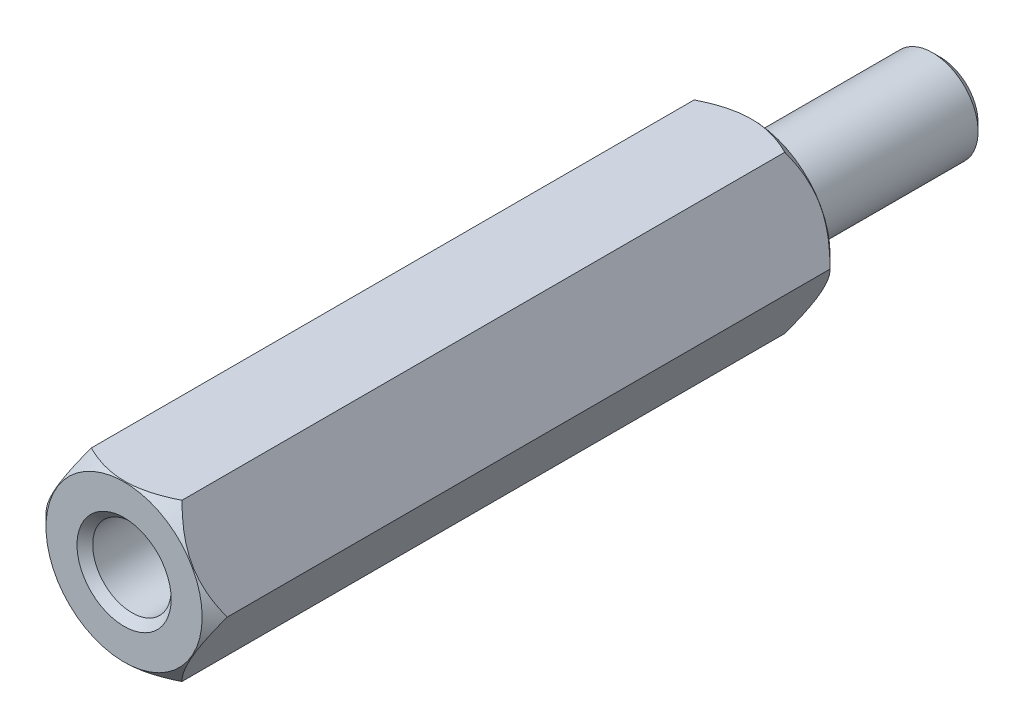
ISO-10303-21;
HEADER;
FILE_DESCRIPTION(('STEP AP214'),'2;1');
FILE_NAME('part.step','',(''),(''),'','','');
FILE_SCHEMA(('AUTOMOTIVE_DESIGN { 1 0 10303 214 1 1 1 1 }'));
ENDSEC;
DATA;
#1=APPLICATION_CONTEXT('core data for automotive mechanical design processes');
#2=APPLICATION_PROTOCOL_DEFINITION('international standard','automotive_design',2000,#1);
#3=PRODUCT_CONTEXT('',#1,'mechanical');
#4=PRODUCT('Part','Part','',(#3));
#5=PRODUCT_RELATED_PRODUCT_CATEGORY('part','',(#4));
#6=PRODUCT_DEFINITION_FORMATION('','',#4);
#7=PRODUCT_DEFINITION_CONTEXT('part definition',#1,'design');
#8=PRODUCT_DEFINITION('design','',#6,#7);
#9=PRODUCT_DEFINITION_SHAPE('','',#8);
#10=(LENGTH_UNIT() NAMED_UNIT(*) SI_UNIT(.MILLI.,.METRE.));
#11=(NAMED_UNIT(*) PLANE_ANGLE_UNIT() SI_UNIT($,.RADIAN.));
#12=(NAMED_UNIT(*) SI_UNIT($,.STERADIAN.) SOLID_ANGLE_UNIT());
#13=UNCERTAINTY_MEASURE_WITH_UNIT(LENGTH_MEASURE(1.E-05),#10,'distance_accuracy_value','');
#14=(GEOMETRIC_REPRESENTATION_CONTEXT(3) GLOBAL_UNCERTAINTY_ASSIGNED_CONTEXT((#13)) GLOBAL_UNIT_ASSIGNED_CONTEXT((#10,
#11,#12)) REPRESENTATION_CONTEXT('',''));
#15=CARTESIAN_POINT('',(0.,0.,0.));
#16=DIRECTION('',(0.,0.,1.));
#17=DIRECTION('',(1.,0.,0.));
#18=AXIS2_PLACEMENT_3D('',#15,#16,#17);
#19=CARTESIAN_POINT('',(0.,0.,10.));
#20=DIRECTION('',(0.,0.,1.));
#21=DIRECTION('',(1.,0.,0.));
#22=AXIS2_PLACEMENT_3D('',#19,#20,#21);
#23=CYLINDRICAL_SURFACE('',#22,1.24999999999999);
#24=CARTESIAN_POINT('',(0.,0.,9.75000000000001));
#25=DIRECTION('',(0.,0.,1.));
#26=DIRECTION('',(1.,0.,0.));
#27=AXIS2_PLACEMENT_3D('',#24,#25,#26);
#28=CIRCLE('',#27,1.24999999999999);
#29=CARTESIAN_POINT('',(1.24999999999999,0.,9.75000000000001));
#30=VERTEX_POINT('',#29);
#31=EDGE_CURVE('E50',#30,#30,#28,.T.);
#32=ORIENTED_EDGE('',*,*,#31,.T.);
#33=EDGE_LOOP('',(#32));
#34=FACE_BOUND('',#33,.T.);
#35=CARTESIAN_POINT('',(0.,0.,-8.));
#36=DIRECTION('',(0.,0.,-1.));
#37=DIRECTION('',(-1.,0.,0.));
#38=AXIS2_PLACEMENT_3D('',#35,#36,#37);
#39=CIRCLE('',#38,1.24999999999999);
#40=CARTESIAN_POINT('',(-1.24999999999999,0.,-8.));
#41=VERTEX_POINT('',#40);
#42=EDGE_CURVE('E117',#41,#41,#39,.F.);
#43=ORIENTED_EDGE('',*,*,#42,.F.);
#44=EDGE_LOOP('',(#43));
#45=FACE_BOUND('',#44,.T.);
#46=ADVANCED_FACE('F40',(#34,#45),#23,.F.);
#47=CARTESIAN_POINT('',(1.44337567297409,-2.49999999999998,10.));
#48=DIRECTION('',(-0.866025403784442,0.499999999999995,0.));
#49=DIRECTION('',(-0.499999999999995,-0.866025403784442,0.));
#50=AXIS2_PLACEMENT_3D('',#47,#48,#49);
#51=PLANE('',#50);
#52=CARTESIAN_POINT('',(1.44326020292026,-2.50019999999999,9.59988452301824));
#53=CARTESIAN_POINT('',(1.49287669073471,-2.41426172221222,9.64945929464527));
#54=CARTESIAN_POINT('',(1.54332283764112,-2.32688643272423,9.69612251863749));
#55=CARTESIAN_POINT('',(1.64618811625262,-2.1487185438344,9.7815618599617));
#56=CARTESIAN_POINT('',(1.69861703122362,-2.05790899931891,9.82029043759399));
#57=CARTESIAN_POINT('',(1.80433744175988,-1.87479587687307,9.88663329610226));
#58=CARTESIAN_POINT('',(1.85760201171318,-1.78253893547065,9.91441433146914));
#59=CARTESIAN_POINT('',(1.96530378549011,-1.5959939912237,9.95721682408933));
#60=CARTESIAN_POINT('',(2.01973769896308,-1.50171168743371,9.97227023332865));
#61=CARTESIAN_POINT('',(2.11355131286834,-1.33922174170815,9.98585227779051));
#62=CARTESIAN_POINT('',(2.15280980880343,-1.27122403211984,9.98786290075919));
#63=CARTESIAN_POINT('',(2.23126263056551,-1.13533975883077,9.98447588281251));
#64=CARTESIAN_POINT('',(2.27045692907359,-1.06745324244775,9.97907564470017));
#65=CARTESIAN_POINT('',(2.34847544336506,-0.932321211763883,9.96117421159752));
#66=CARTESIAN_POINT('',(2.38729919566124,-0.865076500246428,9.94866507295351));
#67=CARTESIAN_POINT('',(2.46427534467605,-0.731749899181788,9.91723249804429));
#68=CARTESIAN_POINT('',(2.50242779262543,-0.66566792090033,9.89830955350318));
#69=CARTESIAN_POINT('',(2.60015256308363,-0.496403653308724,9.84213263859175));
#70=CARTESIAN_POINT('',(2.6591189485299,-0.394270877777098,9.80064416840381));
#71=CARTESIAN_POINT('',(2.74582384890658,-0.244093585059486,9.73060595327691));
#72=CARTESIAN_POINT('',(2.77439698586413,-0.194603460117387,9.70599774788392));
#73=CARTESIAN_POINT('',(2.83101398781794,-0.0965399361611519,9.65453811328476));
#74=CARTESIAN_POINT('',(2.85905816495513,-0.0479659965030718,9.62768806122065));
#75=CARTESIAN_POINT('',(2.88686681600197,0.000199999999999628,9.59988452301824));
#76=B_SPLINE_CURVE_WITH_KNOTS('',3,(#52,#53,#54,#55,#56,#57,#58,#59,#60,#61,#62,#63,#64,#65,#66,
#67,#68,#69,#70,#71,#72,#73,#74,#75),.UNSPECIFIED.,.F.,.F.,(4,2,2,2,2,2,2,2,2,2,2,4),(0.,
0.333012085133922,0.667964518301391,0.99759703204329,1.32639954393843,1.56169424147167,
1.79707142102082,2.0327121352217,2.2683347877565,2.64260240809531,2.82922877818861,
3.01574133749022),.UNSPECIFIED.);
#77=CARTESIAN_POINT('',(1.4433756729741,-2.49999999999999,9.6));
#78=VERTEX_POINT('',#77);
#79=CARTESIAN_POINT('',(2.88675134594813,0.,9.6));
#80=VERTEX_POINT('',#79);
#81=EDGE_CURVE('E94',#78,#80,#76,.T.);
#82=ORIENTED_EDGE('',*,*,#81,.F.);
#83=DIRECTION('',(0.,0.,-1.));
#84=VECTOR('',#83,1.);
#85=CARTESIAN_POINT('',(1.44337567297409,-2.49999999999998,10.));
#86=LINE('',#85,#84);
#87=CARTESIAN_POINT('',(1.44337567297409,-2.49999999999998,-9.60000000000001));
#88=VERTEX_POINT('',#87);
#89=EDGE_CURVE('E65',#78,#88,#86,.T.);
#90=ORIENTED_EDGE('',*,*,#89,.T.);
#91=CARTESIAN_POINT('',(2.88686681600197,0.0002,-9.59988452301824));
#92=CARTESIAN_POINT('',(2.83725032818751,-0.0857382777877641,-9.64945929464528));
#93=CARTESIAN_POINT('',(2.7868041812811,-0.173113567275752,-9.69612251863749));
#94=CARTESIAN_POINT('',(2.68393890266961,-0.351281456165586,-9.7815618599617));
#95=CARTESIAN_POINT('',(2.63150998769861,-0.442091000681072,-9.82029043759399));
#96=CARTESIAN_POINT('',(2.52578957716235,-0.625204123126917,-9.88663329610226));
#97=CARTESIAN_POINT('',(2.47252500720905,-0.717461064529336,-9.91441433146914));
#98=CARTESIAN_POINT('',(2.36482323343211,-0.90400600877628,-9.95721682408933));
#99=CARTESIAN_POINT('',(2.31038931995914,-0.998288312566276,-9.97227023332865));
#100=CARTESIAN_POINT('',(2.21657570605388,-1.16077825829184,-9.98585227779051));
#101=CARTESIAN_POINT('',(2.1773172101188,-1.22877596788014,-9.98786290075919));
#102=CARTESIAN_POINT('',(2.09886438835672,-1.36466024116921,-9.98447588281251));
#103=CARTESIAN_POINT('',(2.05967008984864,-1.43254675755223,-9.97907564470017));
#104=CARTESIAN_POINT('',(1.98165157555716,-1.5676787882361,-9.96117421159752));
#105=CARTESIAN_POINT('',(1.94282782326098,-1.63492349975355,-9.94866507295351));
#106=CARTESIAN_POINT('',(1.86585167424618,-1.76825010081819,-9.91723249804429));
#107=CARTESIAN_POINT('',(1.8276992262968,-1.83433207909965,-9.89830955350318));
#108=CARTESIAN_POINT('',(1.7299744558386,-2.00359634669126,-9.84213263859175));
#109=CARTESIAN_POINT('',(1.67100807039233,-2.10572912222288,-9.80064416840381));
#110=CARTESIAN_POINT('',(1.58430317001565,-2.2559064149405,-9.73060595327691));
#111=CARTESIAN_POINT('',(1.5557300330581,-2.3053965398826,-9.70599774788392));
#112=CARTESIAN_POINT('',(1.49911303110428,-2.40346006383883,-9.65453811328476));
#113=CARTESIAN_POINT('',(1.47106885396709,-2.45203400349691,-9.62768806122065));
#114=CARTESIAN_POINT('',(1.44326020292026,-2.50019999999999,-9.59988452301824));
#115=B_SPLINE_CURVE_WITH_KNOTS('',3,(#91,#92,#93,#94,#95,#96,#97,#98,#99,#100,#101,#102,#103,
#104,#105,#106,#107,#108,#109,#110,#111,#112,#113,#114),.UNSPECIFIED.,.F.,.F.,(4,2,2,2,2,2,2,2,
2,2,2,4),(0.,0.33301208513392,0.667964518301389,0.997597032043288,1.32639954393843,
1.56169424147167,1.79707142102081,2.03271213522169,2.26833478775649,2.64260240809531,
2.82922877818861,3.01574133749022),.UNSPECIFIED.);
#116=CARTESIAN_POINT('',(2.88675134594813,0.,-9.6));
#117=VERTEX_POINT('',#116);
#118=EDGE_CURVE('E115',#117,#88,#115,.T.);
#119=ORIENTED_EDGE('',*,*,#118,.F.);
#120=DIRECTION('',(0.,0.,-1.));
#121=VECTOR('',#120,1.);
#122=CARTESIAN_POINT('',(2.88675134594813,0.,10.));
#123=LINE('',#122,#121);
#124=EDGE_CURVE('E108',#80,#117,#123,.T.);
#125=ORIENTED_EDGE('',*,*,#124,.F.);
#126=EDGE_LOOP('',(#82,#90,#119,#125));
#127=FACE_BOUND('',#126,.T.);
#128=ADVANCED_FACE('F114',(#127),#51,.F.);
#129=CARTESIAN_POINT('',(2.88675134594813,0.,10.));
#130=DIRECTION('',(-0.866025403784438,-0.500000000000001,0.));
#131=DIRECTION('',(0.500000000000001,-0.866025403784438,0.));
#132=AXIS2_PLACEMENT_3D('',#129,#130,#131);
#133=PLANE('',#132);
#134=CARTESIAN_POINT('',(2.88686681600197,-0.000199999999999787,9.59988452301824));
#135=CARTESIAN_POINT('',(2.83725032818751,0.085738277787765,9.64945929464528));
#136=CARTESIAN_POINT('',(2.7868041812811,0.173113567275754,9.6961225186375));
#137=CARTESIAN_POINT('',(2.6839389026696,0.351281456165589,9.7815618599617));
#138=CARTESIAN_POINT('',(2.6315099876986,0.442091000681075,9.820290437594));
#139=CARTESIAN_POINT('',(2.52578957716234,0.625204123126922,9.88663329610226));
#140=CARTESIAN_POINT('',(2.47252500720904,0.717461064529341,9.91441433146915));
#141=CARTESIAN_POINT('',(2.3648232334321,0.904006008776286,9.95721682408934));
#142=CARTESIAN_POINT('',(2.31038931995913,0.998288312566284,9.97227023332866));
#143=CARTESIAN_POINT('',(2.21657570605387,1.16077825829185,9.98585227779052));
#144=CARTESIAN_POINT('',(2.17731721011878,1.22877596788015,9.9878629007592));
#145=CARTESIAN_POINT('',(2.0988643883567,1.36466024116922,9.98447588281252));
#146=CARTESIAN_POINT('',(2.05967008984862,1.43254675755224,9.97907564470018));
#147=CARTESIAN_POINT('',(1.98165157555715,1.56767878823611,9.96117421159753));
#148=CARTESIAN_POINT('',(1.94282782326097,1.63492349975356,9.94866507295352));
#149=CARTESIAN_POINT('',(1.86585167424616,1.7682501008182,9.9172324980443));
#150=CARTESIAN_POINT('',(1.82769922629678,1.83433207909966,9.89830955350319));
#151=CARTESIAN_POINT('',(1.72997445583858,2.00359634669127,9.84213263859176));
#152=CARTESIAN_POINT('',(1.67100807039231,2.1057291222229,9.80064416840382));
#153=CARTESIAN_POINT('',(1.58430317001562,2.25590641494051,9.73060595327692));
#154=CARTESIAN_POINT('',(1.55573003305807,2.30539653988261,9.70599774788393));
#155=CARTESIAN_POINT('',(1.49911303110425,2.40346006383885,9.65453811328477));
#156=CARTESIAN_POINT('',(1.47106885396706,2.45203400349693,9.62768806122065));
#157=CARTESIAN_POINT('',(1.44326020292022,2.50020000000001,9.59988452301824));
#158=B_SPLINE_CURVE_WITH_KNOTS('',3,(#134,#135,#136,#137,#138,#139,#140,#141,#142,#143,#144,
#145,#146,#147,#148,#149,#150,#151,#152,#153,#154,#155,#156,#157),.UNSPECIFIED.,.F.,.F.,(4,2,2,
2,2,2,2,2,2,2,2,4),(0.,0.333012085133925,0.667964518301398,0.9975970320433,1.32639954393844,
1.56169424147169,1.79707142102083,2.03271213522171,2.26833478775651,2.64260240809534,
2.82922877818864,3.01574133749026),.UNSPECIFIED.);
#159=CARTESIAN_POINT('',(1.44337567297406,2.50000000000001,9.6));
#160=VERTEX_POINT('',#159);
#161=EDGE_CURVE('E97',#80,#160,#158,.T.);
#162=ORIENTED_EDGE('',*,*,#161,.F.);
#163=ORIENTED_EDGE('',*,*,#124,.T.);
#164=CARTESIAN_POINT('',(1.44326020292022,2.50020000000001,-9.59988452301824));
#165=CARTESIAN_POINT('',(1.49287669073468,2.41426172221224,-9.64945929464528));
#166=CARTESIAN_POINT('',(1.54332283764109,2.32688643272425,-9.6961225186375));
#167=CARTESIAN_POINT('',(1.64618811625259,2.14871854383442,-9.7815618599617));
#168=CARTESIAN_POINT('',(1.69861703122359,2.05790899931893,-9.820290437594));
#169=CARTESIAN_POINT('',(1.80433744175985,1.87479587687308,-9.88663329610226));
#170=CARTESIAN_POINT('',(1.85760201171315,1.78253893547066,-9.91441433146915));
#171=CARTESIAN_POINT('',(1.96530378549009,1.59599399122372,-9.95721682408934));
#172=CARTESIAN_POINT('',(2.01973769896306,1.50171168743372,-9.97227023332866));
#173=CARTESIAN_POINT('',(2.11355131286832,1.33922174170816,-9.98585227779052));
#174=CARTESIAN_POINT('',(2.15280980880341,1.27122403211985,-9.9878629007592));
#175=CARTESIAN_POINT('',(2.23126263056549,1.13533975883079,-9.98447588281252));
#176=CARTESIAN_POINT('',(2.27045692907357,1.06745324244777,-9.97907564470018));
#177=CARTESIAN_POINT('',(2.34847544336504,0.932321211763899,-9.96117421159753));
#178=CARTESIAN_POINT('',(2.38729919566123,0.865076500246445,-9.94866507295352));
#179=CARTESIAN_POINT('',(2.46427534467603,0.731749899181806,-9.9172324980443));
#180=CARTESIAN_POINT('',(2.50242779262542,0.665667920900348,-9.89830955350319));
#181=CARTESIAN_POINT('',(2.60015256308362,0.49640365330874,-9.84213263859176));
#182=CARTESIAN_POINT('',(2.65911894852989,0.394270877777111,-9.80064416840382));
#183=CARTESIAN_POINT('',(2.74582384890657,0.244093585059494,-9.73060595327692));
#184=CARTESIAN_POINT('',(2.77439698586412,0.194603460117393,-9.70599774788393));
#185=CARTESIAN_POINT('',(2.83101398781794,0.0965399361611548,-9.65453811328477));
#186=CARTESIAN_POINT('',(2.85905816495513,0.0479659965030731,-9.62768806122065));
#187=CARTESIAN_POINT('',(2.88686681600197,-0.000199999999999539,-9.59988452301824));
#188=B_SPLINE_CURVE_WITH_KNOTS('',3,(#164,#165,#166,#167,#168,#169,#170,#171,#172,#173,#174,
#175,#176,#177,#178,#179,#180,#181,#182,#183,#184,#185,#186,#187),.UNSPECIFIED.,.F.,.F.,(4,2,2,
2,2,2,2,2,2,2,2,4),(0.,0.333012085133926,0.6679645183014,0.997597032043303,1.32639954393845,
1.56169424147169,1.79707142102083,2.03271213522171,2.26833478775651,2.64260240809534,
2.82922877818864,3.01574133749026),.UNSPECIFIED.);
#189=CARTESIAN_POINT('',(1.44337567297406,2.50000000000001,-9.6));
#190=VERTEX_POINT('',#189);
#191=EDGE_CURVE('E250',#190,#117,#188,.T.);
#192=ORIENTED_EDGE('',*,*,#191,.F.);
#193=DIRECTION('',(0.,0.,-1.));
#194=VECTOR('',#193,1.);
#195=CARTESIAN_POINT('',(1.44337567297406,2.50000000000001,10.));
#196=LINE('',#195,#194);
#197=EDGE_CURVE('E110',#160,#190,#196,.T.);
#198=ORIENTED_EDGE('',*,*,#197,.F.);
#199=EDGE_LOOP('',(#162,#163,#192,#198));
#200=FACE_BOUND('',#199,.T.);
#201=ADVANCED_FACE('F106',(#200),#133,.F.);
#202=CARTESIAN_POINT('',(1.44337567297406,2.50000000000001,10.));
#203=DIRECTION('',(0.,-1.,0.));
#204=DIRECTION('',(1.,0.,0.));
#205=AXIS2_PLACEMENT_3D('',#202,#203,#204);
#206=PLANE('',#205);
#207=CARTESIAN_POINT('',(4.35790807222665,2.50000000000002,7.46267304580409));
#208=CARTESIAN_POINT('',(4.22900505074815,2.50000000000001,7.57444020651168));
#209=CARTESIAN_POINT('',(4.09952897907173,2.50000000000001,7.68556009439584));
#210=CARTESIAN_POINT('',(3.83898638028681,2.50000000000001,7.90604374915114));
#211=CARTESIAN_POINT('',(3.70791912620545,2.50000000000001,8.01540665588043));
#212=CARTESIAN_POINT('',(3.44083760855067,2.50000000000001,8.23429407491961));
#213=CARTESIAN_POINT('',(3.30477887797079,2.50000000000001,8.34376454299069));
#214=CARTESIAN_POINT('',(3.03009587684347,2.50000000000001,8.55938263287972));
#215=CARTESIAN_POINT('',(2.89147225782007,2.50000000000001,8.6655310805966));
#216=CARTESIAN_POINT('',(2.61062429451692,2.50000000000001,8.87338578520497));
#217=CARTESIAN_POINT('',(2.46839537969833,2.50000000000001,8.97508590704005));
#218=CARTESIAN_POINT('',(2.17925486790779,2.50000000000001,9.17194970638112));
#219=CARTESIAN_POINT('',(2.03233957265131,2.50000000000001,9.26710802470617));
#220=CARTESIAN_POINT('',(1.73361597358268,2.50000000000001,9.44680833734888));
#221=CARTESIAN_POINT('',(1.58185407011246,2.50000000000001,9.5314264527755));
#222=CARTESIAN_POINT('',(1.27084130527911,2.5,9.68552599595446));
#223=CARTESIAN_POINT('',(1.11160488303032,2.5,9.75503525688873));
#224=CARTESIAN_POINT('',(0.864657376231804,2.5,9.84259642513528));
#225=CARTESIAN_POINT('',(0.77999302622252,2.5,9.86920046305057));
#226=CARTESIAN_POINT('',(0.608668935092173,2.5,9.91504582346073));
#227=CARTESIAN_POINT('',(0.522009514777892,2.5,9.93428832104285));
#228=CARTESIAN_POINT('',(0.347739556932336,2.5,9.9641318069513));
#229=CARTESIAN_POINT('',(0.260138222188822,2.5,9.97478552783329));
#230=CARTESIAN_POINT('',(0.0842961272603139,2.5,9.98686770307153));
#231=CARTESIAN_POINT('',(-0.00394456438844589,2.5,9.98829713200226));
#232=CARTESIAN_POINT('',(-0.180192018780213,2.5,9.98181608276146));
#233=CARTESIAN_POINT('',(-0.268198313940587,2.5,9.97389317264444));
#234=CARTESIAN_POINT('',(-0.442968473014178,2.5,9.94928693602144));
#235=CARTESIAN_POINT('',(-0.529732088460509,2.5,9.93260188201526));
#236=CARTESIAN_POINT('',(-0.70200364163614,2.5,9.89141807606219));
#237=CARTESIAN_POINT('',(-0.787498274243356,2.5,9.86686463906262));
#238=CARTESIAN_POINT('',(-0.956318998116786,2.5,9.81127227919823));
#239=CARTESIAN_POINT('',(-1.03964506444263,2.5,9.78023328178095));
#240=CARTESIAN_POINT('',(-1.22260914379837,2.5,9.70532752613879));
#241=CARTESIAN_POINT('',(-1.32170415747565,2.5,9.66014559308747));
#242=CARTESIAN_POINT('',(-1.51694385371061,2.49999999999999,9.56375515379207));
#243=CARTESIAN_POINT('',(-1.61308679170487,2.49999999999999,9.51254316726495));
#244=CARTESIAN_POINT('',(-1.80296614219631,2.49999999999999,9.40543166741101));
#245=CARTESIAN_POINT('',(-1.89669715950609,2.49999999999999,9.34952266760245));
#246=CARTESIAN_POINT('',(-2.08192800240941,2.49999999999999,9.23418674307865));
#247=CARTESIAN_POINT('',(-2.17342826625815,2.49999999999999,9.17476051735267));
#248=CARTESIAN_POINT('',(-2.35505847652762,2.49999999999999,9.05284030367592));
#249=CARTESIAN_POINT('',(-2.44517856997304,2.49999999999999,8.99033170499245));
#250=CARTESIAN_POINT('',(-2.62385919422449,2.49999999999999,8.86311875000847));
#251=CARTESIAN_POINT('',(-2.71241960671455,2.49999999999999,8.79841422820775));
#252=CARTESIAN_POINT('',(-2.97593968609535,2.49999999999999,8.60184992046111));
#253=CARTESIAN_POINT('',(-3.14895696314842,2.49999999999999,8.46738929484149));
#254=CARTESIAN_POINT('',(-3.49727644035017,2.49999999999999,8.18911816701068));
#255=CARTESIAN_POINT('',(-3.6724475097082,2.49999999999999,8.04514512901893));
#256=CARTESIAN_POINT('',(-3.9321211000153,2.49999999999999,7.82741624538674));
#257=CARTESIAN_POINT('',(-4.01770626505476,2.49999999999999,7.75494531232854));
#258=CARTESIAN_POINT('',(-4.18824952148341,2.49999999999999,7.60930608888149));
#259=CARTESIAN_POINT('',(-4.2732077442148,2.49999999999999,7.53613795236393));
#260=CARTESIAN_POINT('',(-4.35790807222667,2.49999999999999,7.46267304580409));
#261=B_SPLINE_CURVE_WITH_KNOTS('',3,(#207,#208,#209,#210,#211,#212,#213,#214,#215,#216,#217,
#218,#219,#220,#221,#222,#223,#224,#225,#226,#227,#228,#229,#230,#231,#232,#233,#234,#235,#236,
#237,#238,#239,#240,#241,#242,#243,#244,#245,#246,#247,#248,#249,#250,#251,#252,#253,#254,#255,
#256,#257,#258,#259,#260),.UNSPECIFIED.,.F.,.F.,(4,2,2,2,2,2,2,2,2,2,2,2,2,2,2,2,2,2,2,2,2,2,2,
2,2,2,4),(0.,0.511842212813337,1.02392780167291,1.54778169920521,2.0715043079768,
2.59592780979257,3.12077593308527,3.6415817306556,4.16141982425733,4.42739176689035,
4.69332123596952,4.95760526901695,5.22186137919605,5.4864691576042,5.75112912434679,
6.01766988465734,6.28421370906123,6.61066447125655,6.93730457870706,7.26462103112129,
7.59187265192317,7.92086150920113,8.24987521669916,8.90710736338424,9.58728616124552,
9.92372274140157,10.2600867154781),.UNSPECIFIED.);
#262=CARTESIAN_POINT('',(-1.44337567297408,2.5,9.6));
#263=VERTEX_POINT('',#262);
#264=EDGE_CURVE('E112',#160,#263,#261,.T.);
#265=ORIENTED_EDGE('',*,*,#264,.F.);
#266=ORIENTED_EDGE('',*,*,#197,.T.);
#267=CARTESIAN_POINT('',(-4.35790807222667,2.49999999999999,-7.46267304580409));
#268=CARTESIAN_POINT('',(-4.22900505074817,2.49999999999999,-7.57444020651168));
#269=CARTESIAN_POINT('',(-4.09952897907174,2.49999999999999,-7.68556009439584));
#270=CARTESIAN_POINT('',(-3.83898638028682,2.49999999999999,-7.90604374915114));
#271=CARTESIAN_POINT('',(-3.70791912620547,2.49999999999999,-8.01540665588043));
#272=CARTESIAN_POINT('',(-3.44083760855069,2.49999999999999,-8.23429407491961));
#273=CARTESIAN_POINT('',(-3.30477887797081,2.49999999999999,-8.34376454299069));
#274=CARTESIAN_POINT('',(-3.03009587684349,2.49999999999999,-8.55938263287972));
#275=CARTESIAN_POINT('',(-2.89147225782008,2.49999999999999,-8.6655310805966));
#276=CARTESIAN_POINT('',(-2.61062429451694,2.49999999999999,-8.87338578520497));
#277=CARTESIAN_POINT('',(-2.46839537969835,2.49999999999999,-8.97508590704005));
#278=CARTESIAN_POINT('',(-2.17925486790781,2.49999999999999,-9.17194970638112));
#279=CARTESIAN_POINT('',(-2.03233957265133,2.49999999999999,-9.26710802470617));
#280=CARTESIAN_POINT('',(-1.7336159735827,2.49999999999999,-9.44680833734888));
#281=CARTESIAN_POINT('',(-1.58185407011247,2.49999999999999,-9.5314264527755));
#282=CARTESIAN_POINT('',(-1.27084130527912,2.5,-9.68552599595446));
#283=CARTESIAN_POINT('',(-1.11160488303033,2.5,-9.75503525688873));
#284=CARTESIAN_POINT('',(-0.864657376231821,2.5,-9.84259642513528));
#285=CARTESIAN_POINT('',(-0.779993026222537,2.5,-9.86920046305057));
#286=CARTESIAN_POINT('',(-0.608668935092189,2.5,-9.91504582346073));
#287=CARTESIAN_POINT('',(-0.522009514777909,2.5,-9.93428832104285));
#288=CARTESIAN_POINT('',(-0.347739556932353,2.5,-9.9641318069513));
#289=CARTESIAN_POINT('',(-0.260138222188839,2.5,-9.97478552783329));
#290=CARTESIAN_POINT('',(-0.0842961272603305,2.5,-9.98686770307153));
#291=CARTESIAN_POINT('',(0.0039445643884292,2.5,-9.98829713200226));
#292=CARTESIAN_POINT('',(0.180192018780197,2.5,-9.98181608276146));
#293=CARTESIAN_POINT('',(0.26819831394057,2.5,-9.97389317264444));
#294=CARTESIAN_POINT('',(0.442968473014161,2.5,-9.94928693602144));
#295=CARTESIAN_POINT('',(0.529732088460492,2.5,-9.93260188201526));
#296=CARTESIAN_POINT('',(0.702003641636123,2.5,-9.89141807606219));
#297=CARTESIAN_POINT('',(0.78749827424334,2.5,-9.86686463906262));
#298=CARTESIAN_POINT('',(0.956318998116769,2.5,-9.81127227919823));
#299=CARTESIAN_POINT('',(1.03964506444261,2.5,-9.78023328178095));
#300=CARTESIAN_POINT('',(1.22260914379835,2.5,-9.70532752613879));
#301=CARTESIAN_POINT('',(1.32170415747563,2.5,-9.66014559308747));
#302=CARTESIAN_POINT('',(1.51694385371059,2.50000000000001,-9.56375515379207));
#303=CARTESIAN_POINT('',(1.61308679170485,2.50000000000001,-9.51254316726495));
#304=CARTESIAN_POINT('',(1.80296614219629,2.50000000000001,-9.40543166741101));
#305=CARTESIAN_POINT('',(1.89669715950607,2.50000000000001,-9.34952266760245));
#306=CARTESIAN_POINT('',(2.08192800240939,2.50000000000001,-9.23418674307865));
#307=CARTESIAN_POINT('',(2.17342826625813,2.50000000000001,-9.17476051735267));
#308=CARTESIAN_POINT('',(2.3550584765276,2.50000000000001,-9.05284030367592));
#309=CARTESIAN_POINT('',(2.44517856997302,2.50000000000001,-8.99033170499245));
#310=CARTESIAN_POINT('',(2.62385919422447,2.50000000000001,-8.86311875000847));
#311=CARTESIAN_POINT('',(2.71241960671454,2.50000000000001,-8.79841422820775));
#312=CARTESIAN_POINT('',(2.97593968609533,2.50000000000001,-8.60184992046111));
#313=CARTESIAN_POINT('',(3.14895696314841,2.50000000000001,-8.46738929484149));
#314=CARTESIAN_POINT('',(3.49727644035015,2.50000000000001,-8.18911816701068));
#315=CARTESIAN_POINT('',(3.67244750970818,2.50000000000001,-8.04514512901893));
#316=CARTESIAN_POINT('',(3.93212110001529,2.50000000000001,-7.82741624538673));
#317=CARTESIAN_POINT('',(4.01770626505474,2.50000000000001,-7.75494531232854));
#318=CARTESIAN_POINT('',(4.18824952148339,2.50000000000001,-7.60930608888149));
#319=CARTESIAN_POINT('',(4.27320774421478,2.50000000000001,-7.53613795236393));
#320=CARTESIAN_POINT('',(4.35790807222665,2.50000000000002,-7.46267304580409));
#321=B_SPLINE_CURVE_WITH_KNOTS('',3,(#267,#268,#269,#270,#271,#272,#273,#274,#275,#276,#277,
#278,#279,#280,#281,#282,#283,#284,#285,#286,#287,#288,#289,#290,#291,#292,#293,#294,#295,#296,
#297,#298,#299,#300,#301,#302,#303,#304,#305,#306,#307,#308,#309,#310,#311,#312,#313,#314,#315,
#316,#317,#318,#319,#320),.UNSPECIFIED.,.F.,.F.,(4,2,2,2,2,2,2,2,2,2,2,2,2,2,2,2,2,2,2,2,2,2,2,
2,2,2,4),(0.,0.511842212813336,1.02392780167291,1.54778169920521,2.0715043079768,
2.59592780979257,3.12077593308528,3.6415817306556,4.16141982425734,4.42739176689035,
4.69332123596952,4.95760526901695,5.22186137919605,5.4864691576042,5.75112912434679,
6.01766988465734,6.28421370906123,6.61066447125655,6.93730457870706,7.2646210311213,
7.59187265192318,7.92086150920113,8.24987521669917,8.90710736338424,9.58728616124552,
9.92372274140157,10.2600867154781),.UNSPECIFIED.);
#322=CARTESIAN_POINT('',(-1.44337567297408,2.5,-9.6));
#323=VERTEX_POINT('',#322);
#324=EDGE_CURVE('E258',#323,#190,#321,.T.);
#325=ORIENTED_EDGE('',*,*,#324,.F.);
#326=DIRECTION('',(0.,0.,-1.));
#327=VECTOR('',#326,1.);
#328=CARTESIAN_POINT('',(-1.44337567297408,2.5,10.));
#329=LINE('',#328,#327);
#330=EDGE_CURVE('E126',#263,#323,#329,.T.);
#331=ORIENTED_EDGE('',*,*,#330,.F.);
#332=EDGE_LOOP('',(#265,#266,#325,#331));
#333=FACE_BOUND('',#332,.T.);
#334=ADVANCED_FACE('F244',(#333),#206,.F.);
#335=CARTESIAN_POINT('',(-1.44337567297408,2.5,10.));
#336=DIRECTION('',(0.866025403784442,-0.499999999999995,0.));
#337=DIRECTION('',(0.499999999999995,0.866025403784442,0.));
#338=AXIS2_PLACEMENT_3D('',#335,#336,#337);
#339=PLANE('',#338);
#340=CARTESIAN_POINT('',(-1.44326020292024,2.5002,9.59988452301824));
#341=CARTESIAN_POINT('',(-1.4928766907347,2.41426172221223,9.64945929464528));
#342=CARTESIAN_POINT('',(-1.54332283764111,2.32688643272424,9.6961225186375));
#343=CARTESIAN_POINT('',(-1.6461881162526,2.14871854383441,9.7815618599617));
#344=CARTESIAN_POINT('',(-1.6986170312236,2.05790899931892,9.820290437594));
#345=CARTESIAN_POINT('',(-1.80433744175987,1.87479587687307,9.88663329610226));
#346=CARTESIAN_POINT('',(-1.85760201171316,1.78253893547065,9.91441433146915));
#347=CARTESIAN_POINT('',(-1.9653037854901,1.5959939912237,9.95721682408934));
#348=CARTESIAN_POINT('',(-2.01973769896307,1.50171168743371,9.97227023332866));
#349=CARTESIAN_POINT('',(-2.11355131286833,1.33922174170814,9.98585227779052));
#350=CARTESIAN_POINT('',(-2.15280980880342,1.27122403211984,9.9878629007592));
#351=CARTESIAN_POINT('',(-2.2312626305655,1.13533975883077,9.98447588281252));
#352=CARTESIAN_POINT('',(-2.27045692907358,1.06745324244775,9.97907564470018));
#353=CARTESIAN_POINT('',(-2.34847544336505,0.932321211763883,9.96117421159753));
#354=CARTESIAN_POINT('',(-2.38729919566123,0.865076500246428,9.94866507295352));
#355=CARTESIAN_POINT('',(-2.46427534467604,0.731749899181789,9.9172324980443));
#356=CARTESIAN_POINT('',(-2.50242779262542,0.665667920900331,9.89830955350319));
#357=CARTESIAN_POINT('',(-2.60015256308362,0.496403653308722,9.84213263859176));
#358=CARTESIAN_POINT('',(-2.65911894852989,0.394270877777092,9.80064416840382));
#359=CARTESIAN_POINT('',(-2.74582384890657,0.244093585059475,9.73060595327692));
#360=CARTESIAN_POINT('',(-2.77439698586412,0.194603460117374,9.70599774788393));
#361=CARTESIAN_POINT('',(-2.83101398781794,0.0965399361611354,9.65453811328477));
#362=CARTESIAN_POINT('',(-2.85905816495513,0.0479659965030536,9.62768806122065));
#363=CARTESIAN_POINT('',(-2.88686681600197,-0.000200000000019625,9.59988452301824));
#364=B_SPLINE_CURVE_WITH_KNOTS('',3,(#340,#341,#342,#343,#344,#345,#346,#347,#348,#349,#350,
#351,#352,#353,#354,#355,#356,#357,#358,#359,#360,#361,#362,#363),.UNSPECIFIED.,.F.,.F.,(4,2,2,
2,2,2,2,2,2,2,2,4),(0.,0.333012085133925,0.667964518301399,0.997597032043302,1.32639954393845,
1.56169424147169,1.79707142102083,2.03271213522171,2.26833478775651,2.64260240809534,
2.82922877818864,3.01574133749026),.UNSPECIFIED.);
#365=CARTESIAN_POINT('',(-2.88675134594813,0.,9.6));
#366=VERTEX_POINT('',#365);
#367=EDGE_CURVE('E222',#263,#366,#364,.T.);
#368=ORIENTED_EDGE('',*,*,#367,.F.);
#369=ORIENTED_EDGE('',*,*,#330,.T.);
#370=CARTESIAN_POINT('',(-2.88686681600197,-0.000200000000020158,-9.59988452301824));
#371=CARTESIAN_POINT('',(-2.83725032818751,0.0857382777877453,-9.64945929464528));
#372=CARTESIAN_POINT('',(-2.7868041812811,0.173113567275734,-9.6961225186375));
#373=CARTESIAN_POINT('',(-2.68393890266961,0.351281456165571,-9.7815618599617));
#374=CARTESIAN_POINT('',(-2.6315099876986,0.442091000681057,-9.820290437594));
#375=CARTESIAN_POINT('',(-2.52578957716234,0.625204123126904,-9.88663329610226));
#376=CARTESIAN_POINT('',(-2.47252500720904,0.717461064529324,-9.91441433146915));
#377=CARTESIAN_POINT('',(-2.36482323343211,0.90400600877627,-9.95721682408934));
#378=CARTESIAN_POINT('',(-2.31038931995913,0.998288312566268,-9.97227023332866));
#379=CARTESIAN_POINT('',(-2.21657570605388,1.16077825829183,-9.98585227779052));
#380=CARTESIAN_POINT('',(-2.17731721011879,1.22877596788014,-9.9878629007592));
#381=CARTESIAN_POINT('',(-2.09886438835671,1.3646602411692,-9.98447588281252));
#382=CARTESIAN_POINT('',(-2.05967008984863,1.43254675755222,-9.97907564470018));
#383=CARTESIAN_POINT('',(-1.98165157555716,1.56767878823609,-9.96117421159753));
#384=CARTESIAN_POINT('',(-1.94282782326098,1.63492349975355,-9.94866507295352));
#385=CARTESIAN_POINT('',(-1.86585167424617,1.76825010081819,-9.9172324980443));
#386=CARTESIAN_POINT('',(-1.82769922629679,1.83433207909964,-9.89830955350319));
#387=CARTESIAN_POINT('',(-1.72997445583859,2.00359634669125,-9.84213263859176));
#388=CARTESIAN_POINT('',(-1.67100807039232,2.10572912222288,-9.80064416840382));
#389=CARTESIAN_POINT('',(-1.58430317001564,2.2559064149405,-9.73060595327692));
#390=CARTESIAN_POINT('',(-1.55573003305809,2.3053965398826,-9.70599774788393));
#391=CARTESIAN_POINT('',(-1.49911303110427,2.40346006383884,-9.65453811328477));
#392=CARTESIAN_POINT('',(-1.47106885396707,2.45203400349692,-9.62768806122065));
#393=CARTESIAN_POINT('',(-1.44326020292024,2.5002,-9.59988452301824));
#394=B_SPLINE_CURVE_WITH_KNOTS('',3,(#370,#371,#372,#373,#374,#375,#376,#377,#378,#379,#380,
#381,#382,#383,#384,#385,#386,#387,#388,#389,#390,#391,#392,#393),.UNSPECIFIED.,.F.,.F.,(4,2,2,
2,2,2,2,2,2,2,2,4),(0.,0.333012085133925,0.667964518301398,0.997597032043301,1.32639954393844,
1.56169424147169,1.79707142102083,2.03271213522171,2.26833478775651,2.64260240809534,
2.82922877818864,3.01574133749026),.UNSPECIFIED.);
#395=CARTESIAN_POINT('',(-2.88675134594813,0.,-9.6));
#396=VERTEX_POINT('',#395);
#397=EDGE_CURVE('E285',#396,#323,#394,.T.);
#398=ORIENTED_EDGE('',*,*,#397,.F.);
#399=DIRECTION('',(0.,0.,-1.));
#400=VECTOR('',#399,1.);
#401=CARTESIAN_POINT('',(-2.88675134594813,0.,10.));
#402=LINE('',#401,#400);
#403=EDGE_CURVE('E275',#366,#396,#402,.T.);
#404=ORIENTED_EDGE('',*,*,#403,.F.);
#405=EDGE_LOOP('',(#368,#369,#398,#404));
#406=FACE_BOUND('',#405,.T.);
#407=ADVANCED_FACE('F283',(#406),#339,.F.);
#408=CARTESIAN_POINT('',(-2.88675134594813,0.,10.));
#409=DIRECTION('',(0.866025403784435,0.500000000000007,0.));
#410=DIRECTION('',(-0.500000000000007,0.866025403784435,0.));
#411=AXIS2_PLACEMENT_3D('',#408,#409,#410);
#412=PLANE('',#411);
#413=CARTESIAN_POINT('',(-2.88686681600197,0.000199999999979628,9.59988452301824));
#414=CARTESIAN_POINT('',(-2.83725032818751,-0.0857382777877848,9.64945929464528));
#415=CARTESIAN_POINT('',(-2.7868041812811,-0.173113567275773,9.6961225186375));
#416=CARTESIAN_POINT('',(-2.6839389026696,-0.351281456165609,9.7815618599617));
#417=CARTESIAN_POINT('',(-2.6315099876986,-0.442091000681095,9.820290437594));
#418=CARTESIAN_POINT('',(-2.52578957716233,-0.625204123126941,9.88663329610226));
#419=CARTESIAN_POINT('',(-2.47252500720903,-0.71746106452936,9.91441433146915));
#420=CARTESIAN_POINT('',(-2.36482323343209,-0.904006008776305,9.95721682408934));
#421=CARTESIAN_POINT('',(-2.31038931995912,-0.998288312566302,9.97227023332866));
#422=CARTESIAN_POINT('',(-2.21657570605386,-1.16077825829186,9.98585227779052));
#423=CARTESIAN_POINT('',(-2.17731721011877,-1.22877596788017,9.9878629007592));
#424=CARTESIAN_POINT('',(-2.09886438835669,-1.36466024116924,9.98447588281252));
#425=CARTESIAN_POINT('',(-2.05967008984861,-1.43254675755225,9.97907564470018));
#426=CARTESIAN_POINT('',(-1.98165157555713,-1.56767878823612,9.96117421159753));
#427=CARTESIAN_POINT('',(-1.94282782326095,-1.63492349975358,9.94866507295352));
#428=CARTESIAN_POINT('',(-1.86585167424615,-1.76825010081821,9.9172324980443));
#429=CARTESIAN_POINT('',(-1.82769922629676,-1.83433207909967,9.89830955350319));
#430=CARTESIAN_POINT('',(-1.72997445583856,-2.00359634669128,9.84213263859176));
#431=CARTESIAN_POINT('',(-1.67100807039229,-2.10572912222291,9.80064416840382));
#432=CARTESIAN_POINT('',(-1.5843031700156,-2.25590641494052,9.73060595327692));
#433=CARTESIAN_POINT('',(-1.55573003305805,-2.30539653988262,9.70599774788393));
#434=CARTESIAN_POINT('',(-1.49911303110424,-2.40346006383886,9.65453811328477));
#435=CARTESIAN_POINT('',(-1.47106885396704,-2.45203400349694,9.62768806122065));
#436=CARTESIAN_POINT('',(-1.4432602029202,-2.50020000000001,9.59988452301824));
#437=B_SPLINE_CURVE_WITH_KNOTS('',3,(#413,#414,#415,#416,#417,#418,#419,#420,#421,#422,#423,
#424,#425,#426,#427,#428,#429,#430,#431,#432,#433,#434,#435,#436),.UNSPECIFIED.,.F.,.F.,(4,2,2,
2,2,2,2,2,2,2,2,4),(0.,0.333012085133925,0.667964518301399,0.997597032043303,1.32639954393845,
1.56169424147169,1.79707142102083,2.03271213522171,2.26833478775651,2.64260240809534,
2.82922877818864,3.01574133749025),.UNSPECIFIED.);
#438=CARTESIAN_POINT('',(-1.44337567297404,-2.50000000000001,9.6));
#439=VERTEX_POINT('',#438);
#440=EDGE_CURVE('E57',#366,#439,#437,.T.);
#441=ORIENTED_EDGE('',*,*,#440,.F.);
#442=ORIENTED_EDGE('',*,*,#403,.T.);
#443=CARTESIAN_POINT('',(-1.4432602029202,-2.50020000000001,-9.59988452301824));
#444=CARTESIAN_POINT('',(-1.49287669073466,-2.41426172221225,-9.64945929464528));
#445=CARTESIAN_POINT('',(-1.54332283764108,-2.32688643272426,-9.6961225186375));
#446=CARTESIAN_POINT('',(-1.64618811625257,-2.14871854383443,-9.7815618599617));
#447=CARTESIAN_POINT('',(-1.69861703122358,-2.05790899931894,-9.820290437594));
#448=CARTESIAN_POINT('',(-1.80433744175984,-1.8747958768731,-9.88663329610226));
#449=CARTESIAN_POINT('',(-1.85760201171314,-1.78253893547068,-9.91441433146915));
#450=CARTESIAN_POINT('',(-1.96530378549008,-1.59599399122373,-9.95721682408934));
#451=CARTESIAN_POINT('',(-2.01973769896305,-1.50171168743373,-9.97227023332866));
#452=CARTESIAN_POINT('',(-2.11355131286831,-1.33922174170817,-9.98585227779052));
#453=CARTESIAN_POINT('',(-2.1528098088034,-1.27122403211987,-9.9878629007592));
#454=CARTESIAN_POINT('',(-2.23126263056548,-1.1353397588308,-9.98447588281252));
#455=CARTESIAN_POINT('',(-2.27045692907357,-1.06745324244778,-9.97907564470018));
#456=CARTESIAN_POINT('',(-2.34847544336504,-0.932321211763915,-9.96117421159753));
#457=CARTESIAN_POINT('',(-2.38729919566122,-0.865076500246461,-9.94866507295352));
#458=CARTESIAN_POINT('',(-2.46427534467603,-0.731749899181823,-9.9172324980443));
#459=CARTESIAN_POINT('',(-2.50242779262541,-0.665667920900365,-9.89830955350319));
#460=CARTESIAN_POINT('',(-2.60015256308361,-0.496403653308758,-9.84213263859176));
#461=CARTESIAN_POINT('',(-2.65911894852988,-0.394270877777129,-9.80064416840382));
#462=CARTESIAN_POINT('',(-2.74582384890657,-0.244093585059513,-9.73060595327692));
#463=CARTESIAN_POINT('',(-2.77439698586412,-0.194603460117412,-9.70599774788393));
#464=CARTESIAN_POINT('',(-2.83101398781794,-0.0965399361611742,-9.65453811328477));
#465=CARTESIAN_POINT('',(-2.85905816495513,-0.0479659965030929,-9.62768806122065));
#466=CARTESIAN_POINT('',(-2.88686681600197,0.00019999999997943,-9.59988452301824));
#467=B_SPLINE_CURVE_WITH_KNOTS('',3,(#443,#444,#445,#446,#447,#448,#449,#450,#451,#452,#453,
#454,#455,#456,#457,#458,#459,#460,#461,#462,#463,#464,#465,#466),.UNSPECIFIED.,.F.,.F.,(4,2,2,
2,2,2,2,2,2,2,2,4),(0.,0.333012085133925,0.667964518301398,0.997597032043302,1.32639954393845,
1.56169424147169,1.79707142102083,2.03271213522171,2.26833478775651,2.64260240809533,
2.82922877818864,3.01574133749025),.UNSPECIFIED.);
#468=CARTESIAN_POINT('',(-1.44337567297404,-2.50000000000002,-9.6));
#469=VERTEX_POINT('',#468);
#470=EDGE_CURVE('E293',#469,#396,#467,.T.);
#471=ORIENTED_EDGE('',*,*,#470,.F.);
#472=DIRECTION('',(0.,0.,-1.));
#473=VECTOR('',#472,1.);
#474=CARTESIAN_POINT('',(-1.44337567297404,-2.50000000000001,10.));
#475=LINE('',#474,#473);
#476=EDGE_CURVE('E272',#439,#469,#475,.T.);
#477=ORIENTED_EDGE('',*,*,#476,.F.);
#478=EDGE_LOOP('',(#441,#442,#471,#477));
#479=FACE_BOUND('',#478,.T.);
#480=ADVANCED_FACE('F183',(#479),#412,.F.);
#481=CARTESIAN_POINT('',(-1.44337567297404,-2.50000000000001,10.));
#482=DIRECTION('',(0.,1.,0.));
#483=DIRECTION('',(-1.,0.,0.));
#484=AXIS2_PLACEMENT_3D('',#481,#482,#483);
#485=PLANE('',#484);
#486=CARTESIAN_POINT('',(-4.35790807222664,-2.50000000000005,7.46267304580409));
#487=CARTESIAN_POINT('',(-4.22900505074813,-2.50000000000004,7.57444020651168));
#488=CARTESIAN_POINT('',(-4.09952897907171,-2.50000000000004,7.68556009439584));
#489=CARTESIAN_POINT('',(-3.83898638028679,-2.50000000000004,7.90604374915114));
#490=CARTESIAN_POINT('',(-3.70791912620543,-2.50000000000004,8.01540665588043));
#491=CARTESIAN_POINT('',(-3.44083760855066,-2.50000000000004,8.23429407491961));
#492=CARTESIAN_POINT('',(-3.30477887797077,-2.50000000000003,8.34376454299069));
#493=CARTESIAN_POINT('',(-3.03009587684345,-2.50000000000003,8.55938263287972));
#494=CARTESIAN_POINT('',(-2.89147225782005,-2.50000000000003,8.6655310805966));
#495=CARTESIAN_POINT('',(-2.6106242945169,-2.50000000000003,8.87338578520497));
#496=CARTESIAN_POINT('',(-2.46839537969832,-2.50000000000003,8.97508590704005));
#497=CARTESIAN_POINT('',(-2.17925486790777,-2.50000000000002,9.17194970638112));
#498=CARTESIAN_POINT('',(-2.0323395726513,-2.50000000000002,9.26710802470617));
#499=CARTESIAN_POINT('',(-1.73361597358266,-2.50000000000002,9.44680833734888));
#500=CARTESIAN_POINT('',(-1.58185407011244,-2.50000000000002,9.5314264527755));
#501=CARTESIAN_POINT('',(-1.27084130527909,-2.50000000000001,9.68552599595446));
#502=CARTESIAN_POINT('',(-1.1116048830303,-2.50000000000001,9.75503525688873));
#503=CARTESIAN_POINT('',(-0.864657376231788,-2.50000000000001,9.84259642513528));
#504=CARTESIAN_POINT('',(-0.779993026222503,-2.50000000000001,9.86920046305057));
#505=CARTESIAN_POINT('',(-0.608668935092156,-2.50000000000001,9.91504582346073));
#506=CARTESIAN_POINT('',(-0.522009514777876,-2.50000000000001,9.93428832104285));
#507=CARTESIAN_POINT('',(-0.347739556932319,-2.5,9.9641318069513));
#508=CARTESIAN_POINT('',(-0.260138222188806,-2.5,9.97478552783329));
#509=CARTESIAN_POINT('',(-0.0842961272602973,-2.5,9.98686770307153));
#510=CARTESIAN_POINT('',(0.00394456438846237,-2.5,9.98829713200227));
#511=CARTESIAN_POINT('',(0.18019201878023,-2.5,9.98181608276146));
#512=CARTESIAN_POINT('',(0.268198313940603,-2.5,9.97389317264444));
#513=CARTESIAN_POINT('',(0.442968473014194,-2.5,9.94928693602144));
#514=CARTESIAN_POINT('',(0.529732088460525,-2.49999999999999,9.93260188201526));
#515=CARTESIAN_POINT('',(0.702003641636157,-2.49999999999999,9.89141807606219));
#516=CARTESIAN_POINT('',(0.787498274243373,-2.49999999999999,9.86686463906262));
#517=CARTESIAN_POINT('',(0.956318998116803,-2.49999999999999,9.81127227919823));
#518=CARTESIAN_POINT('',(1.03964506444265,-2.49999999999999,9.78023328178095));
#519=CARTESIAN_POINT('',(1.22260914379838,-2.49999999999999,9.70532752613879));
#520=CARTESIAN_POINT('',(1.32170415747567,-2.49999999999999,9.66014559308748));
#521=CARTESIAN_POINT('',(1.51694385371063,-2.49999999999998,9.56375515379207));
#522=CARTESIAN_POINT('',(1.61308679170488,-2.49999999999998,9.51254316726495));
#523=CARTESIAN_POINT('',(1.80296614219632,-2.49999999999998,9.40543166741101));
#524=CARTESIAN_POINT('',(1.8966971595061,-2.49999999999998,9.34952266760245));
#525=CARTESIAN_POINT('',(2.08192800240943,-2.49999999999998,9.23418674307865));
#526=CARTESIAN_POINT('',(2.17342826625817,-2.49999999999998,9.17476051735267));
#527=CARTESIAN_POINT('',(2.35505847652763,-2.49999999999998,9.05284030367593));
#528=CARTESIAN_POINT('',(2.44517856997305,-2.49999999999997,8.99033170499245));
#529=CARTESIAN_POINT('',(2.62385919422451,-2.49999999999997,8.86311875000847));
#530=CARTESIAN_POINT('',(2.71241960671457,-2.49999999999997,8.79841422820775));
#531=CARTESIAN_POINT('',(2.97593968609536,-2.49999999999997,8.60184992046111));
#532=CARTESIAN_POINT('',(3.14895696314844,-2.49999999999997,8.46738929484149));
#533=CARTESIAN_POINT('',(3.49727644035018,-2.49999999999996,8.18911816701068));
#534=CARTESIAN_POINT('',(3.67244750970821,-2.49999999999996,8.04514512901893));
#535=CARTESIAN_POINT('',(3.93212110001532,-2.49999999999996,7.82741624538673));
#536=CARTESIAN_POINT('',(4.01770626505478,-2.49999999999996,7.75494531232854));
#537=CARTESIAN_POINT('',(4.18824952148343,-2.49999999999996,7.60930608888149));
#538=CARTESIAN_POINT('',(4.27320774421482,-2.49999999999996,7.53613795236393));
#539=CARTESIAN_POINT('',(4.35790807222669,-2.49999999999995,7.46267304580409));
#540=B_SPLINE_CURVE_WITH_KNOTS('',3,(#486,#487,#488,#489,#490,#491,#492,#493,#494,#495,#496,
#497,#498,#499,#500,#501,#502,#503,#504,#505,#506,#507,#508,#509,#510,#511,#512,#513,#514,#515,
#516,#517,#518,#519,#520,#521,#522,#523,#524,#525,#526,#527,#528,#529,#530,#531,#532,#533,#534,
#535,#536,#537,#538,#539),.UNSPECIFIED.,.F.,.F.,(4,2,2,2,2,2,2,2,2,2,2,2,2,2,2,2,2,2,2,2,2,2,2,
2,2,2,4),(0.,0.511842212813336,1.02392780167291,1.54778169920521,2.07150430797679,
2.59592780979257,3.12077593308527,3.6415817306556,4.16141982425733,4.42739176689035,
4.69332123596952,4.95760526901695,5.22186137919605,5.4864691576042,5.75112912434679,
6.01766988465734,6.28421370906123,6.61066447125655,6.93730457870706,7.26462103112129,
7.59187265192317,7.92086150920113,8.24987521669916,8.90710736338424,9.58728616124552,
9.92372274140157,10.2600867154781),.UNSPECIFIED.);
#541=EDGE_CURVE('E99',#439,#78,#540,.T.);
#542=ORIENTED_EDGE('',*,*,#541,.F.);
#543=ORIENTED_EDGE('',*,*,#476,.T.);
#544=CARTESIAN_POINT('',(4.35790807222669,-2.49999999999995,-7.46267304580409));
#545=CARTESIAN_POINT('',(4.22900505074818,-2.49999999999996,-7.57444020651168));
#546=CARTESIAN_POINT('',(4.09952897907176,-2.49999999999996,-7.68556009439584));
#547=CARTESIAN_POINT('',(3.83898638028684,-2.49999999999996,-7.90604374915114));
#548=CARTESIAN_POINT('',(3.70791912620548,-2.49999999999996,-8.01540665588043));
#549=CARTESIAN_POINT('',(3.44083760855071,-2.49999999999996,-8.23429407491961));
#550=CARTESIAN_POINT('',(3.30477887797082,-2.49999999999997,-8.34376454299069));
#551=CARTESIAN_POINT('',(3.03009587684351,-2.49999999999997,-8.55938263287972));
#552=CARTESIAN_POINT('',(2.8914722578201,-2.49999999999997,-8.6655310805966));
#553=CARTESIAN_POINT('',(2.61062429451696,-2.49999999999997,-8.87338578520497));
#554=CARTESIAN_POINT('',(2.46839537969837,-2.49999999999997,-8.97508590704005));
#555=CARTESIAN_POINT('',(2.17925486790783,-2.49999999999998,-9.17194970638112));
#556=CARTESIAN_POINT('',(2.03233957265135,-2.49999999999998,-9.26710802470617));
#557=CARTESIAN_POINT('',(1.73361597358271,-2.49999999999998,-9.44680833734888));
#558=CARTESIAN_POINT('',(1.58185407011249,-2.49999999999998,-9.5314264527755));
#559=CARTESIAN_POINT('',(1.27084130527914,-2.49999999999999,-9.68552599595446));
#560=CARTESIAN_POINT('',(1.11160488303035,-2.49999999999999,-9.75503525688873));
#561=CARTESIAN_POINT('',(0.864657376231838,-2.49999999999999,-9.84259642513528));
#562=CARTESIAN_POINT('',(0.779993026222553,-2.49999999999999,-9.86920046305057));
#563=CARTESIAN_POINT('',(0.608668935092206,-2.49999999999999,-9.91504582346073));
#564=CARTESIAN_POINT('',(0.522009514777926,-2.49999999999999,-9.93428832104285));
#565=CARTESIAN_POINT('',(0.34773955693237,-2.5,-9.9641318069513));
#566=CARTESIAN_POINT('',(0.260138222188856,-2.5,-9.97478552783329));
#567=CARTESIAN_POINT('',(0.0842961272603477,-2.5,-9.98686770307153));
#568=CARTESIAN_POINT('',(-0.00394456438841225,-2.5,-9.98829713200227));
#569=CARTESIAN_POINT('',(-0.18019201878018,-2.5,-9.98181608276146));
#570=CARTESIAN_POINT('',(-0.268198313940553,-2.5,-9.97389317264444));
#571=CARTESIAN_POINT('',(-0.442968473014144,-2.5,-9.94928693602144));
#572=CARTESIAN_POINT('',(-0.529732088460474,-2.50000000000001,-9.93260188201526));
#573=CARTESIAN_POINT('',(-0.702003641636106,-2.50000000000001,-9.89141807606219));
#574=CARTESIAN_POINT('',(-0.787498274243323,-2.50000000000001,-9.86686463906262));
#575=CARTESIAN_POINT('',(-0.956318998116752,-2.50000000000001,-9.81127227919823));
#576=CARTESIAN_POINT('',(-1.0396450644426,-2.50000000000001,-9.78023328178095));
#577=CARTESIAN_POINT('',(-1.22260914379833,-2.50000000000001,-9.70532752613879));
#578=CARTESIAN_POINT('',(-1.32170415747562,-2.50000000000001,-9.66014559308747));
#579=CARTESIAN_POINT('',(-1.51694385371057,-2.50000000000002,-9.56375515379207));
#580=CARTESIAN_POINT('',(-1.61308679170483,-2.50000000000002,-9.51254316726495));
#581=CARTESIAN_POINT('',(-1.80296614219627,-2.50000000000002,-9.40543166741101));
#582=CARTESIAN_POINT('',(-1.89669715950605,-2.50000000000002,-9.34952266760245));
#583=CARTESIAN_POINT('',(-2.08192800240938,-2.50000000000002,-9.23418674307865));
#584=CARTESIAN_POINT('',(-2.17342826625812,-2.50000000000002,-9.17476051735267));
#585=CARTESIAN_POINT('',(-2.35505847652759,-2.50000000000002,-9.05284030367592));
#586=CARTESIAN_POINT('',(-2.44517856997301,-2.50000000000003,-8.99033170499245));
#587=CARTESIAN_POINT('',(-2.62385919422446,-2.50000000000003,-8.86311875000847));
#588=CARTESIAN_POINT('',(-2.71241960671452,-2.50000000000003,-8.79841422820775));
#589=CARTESIAN_POINT('',(-2.97593968609532,-2.50000000000003,-8.60184992046111));
#590=CARTESIAN_POINT('',(-3.14895696314839,-2.50000000000003,-8.46738929484149));
#591=CARTESIAN_POINT('',(-3.49727644035013,-2.50000000000004,-8.18911816701068));
#592=CARTESIAN_POINT('',(-3.67244750970816,-2.50000000000004,-8.04514512901893));
#593=CARTESIAN_POINT('',(-3.93212110001527,-2.50000000000004,-7.82741624538673));
#594=CARTESIAN_POINT('',(-4.01770626505473,-2.50000000000004,-7.75494531232854));
#595=CARTESIAN_POINT('',(-4.18824952148337,-2.50000000000004,-7.60930608888149));
#596=CARTESIAN_POINT('',(-4.27320774421476,-2.50000000000004,-7.53613795236393));
#597=CARTESIAN_POINT('',(-4.35790807222664,-2.50000000000005,-7.46267304580409));
#598=B_SPLINE_CURVE_WITH_KNOTS('',3,(#544,#545,#546,#547,#548,#549,#550,#551,#552,#553,#554,
#555,#556,#557,#558,#559,#560,#561,#562,#563,#564,#565,#566,#567,#568,#569,#570,#571,#572,#573,
#574,#575,#576,#577,#578,#579,#580,#581,#582,#583,#584,#585,#586,#587,#588,#589,#590,#591,#592,
#593,#594,#595,#596,#597),.UNSPECIFIED.,.F.,.F.,(4,2,2,2,2,2,2,2,2,2,2,2,2,2,2,2,2,2,2,2,2,2,2,
2,2,2,4),(0.,0.511842212813335,1.02392780167291,1.54778169920521,2.0715043079768,
2.59592780979257,3.12077593308528,3.6415817306556,4.16141982425734,4.42739176689035,
4.69332123596952,4.95760526901695,5.22186137919605,5.4864691576042,5.75112912434679,
6.01766988465734,6.28421370906123,6.61066447125656,6.93730457870706,7.2646210311213,
7.59187265192318,7.92086150920113,8.24987521669917,8.90710736338425,9.58728616124553,
9.92372274140157,10.2600867154781),.UNSPECIFIED.);
#599=EDGE_CURVE('E189',#88,#469,#598,.T.);
#600=ORIENTED_EDGE('',*,*,#599,.F.);
#601=ORIENTED_EDGE('',*,*,#89,.F.);
#602=EDGE_LOOP('',(#542,#543,#600,#601));
#603=FACE_BOUND('',#602,.T.);
#604=ADVANCED_FACE('F175',(#603),#485,.F.);
#605=CARTESIAN_POINT('',(0.,0.,10.));
#606=DIRECTION('',(0.,0.,1.));
#607=DIRECTION('',(1.,0.,0.));
#608=AXIS2_PLACEMENT_3D('',#605,#606,#607);
#609=PLANE('',#608);
#610=CARTESIAN_POINT('',(0.,0.,10.));
#611=DIRECTION('',(0.,0.,1.));
#612=DIRECTION('',(1.,0.,0.));
#613=AXIS2_PLACEMENT_3D('',#610,#611,#612);
#614=CIRCLE('',#613,1.49999999999999);
#615=CARTESIAN_POINT('',(1.49999999999999,0.,10.));
#616=VERTEX_POINT('',#615);
#617=EDGE_CURVE('E11',#616,#616,#614,.F.);
#618=ORIENTED_EDGE('',*,*,#617,.T.);
#619=EDGE_LOOP('',(#618));
#620=FACE_BOUND('',#619,.T.);
#621=CARTESIAN_POINT('',(0.,0.,10.));
#622=DIRECTION('',(0.,0.,1.));
#623=DIRECTION('',(1.,0.,0.));
#624=AXIS2_PLACEMENT_3D('',#621,#622,#623);
#625=CIRCLE('',#624,2.48675134594813);
#626=CARTESIAN_POINT('',(2.48675134594813,0.,10.));
#627=VERTEX_POINT('',#626);
#628=EDGE_CURVE('E204',#627,#627,#625,.T.);
#629=ORIENTED_EDGE('',*,*,#628,.T.);
#630=EDGE_LOOP('',(#629));
#631=FACE_BOUND('',#630,.T.);
#632=ADVANCED_FACE('F171',(#620,#631),#609,.T.);
#633=CARTESIAN_POINT('',(0.,0.,-10.));
#634=DIRECTION('',(0.,0.,1.));
#635=DIRECTION('',(1.,0.,0.));
#636=AXIS2_PLACEMENT_3D('',#633,#634,#635);
#637=PLANE('',#636);
#638=CARTESIAN_POINT('',(0.,0.,-10.));
#639=DIRECTION('',(0.,0.,1.));
#640=DIRECTION('',(1.,0.,0.));
#641=AXIS2_PLACEMENT_3D('',#638,#639,#640);
#642=CIRCLE('',#641,1.7);
#643=CARTESIAN_POINT('',(1.7,0.,-10.));
#644=VERTEX_POINT('',#643);
#645=EDGE_CURVE('E141',#644,#644,#642,.T.);
#646=ORIENTED_EDGE('',*,*,#645,.T.);
#647=EDGE_LOOP('',(#646));
#648=FACE_BOUND('',#647,.T.);
#649=CARTESIAN_POINT('',(0.,0.,-10.));
#650=DIRECTION('',(0.,0.,1.));
#651=DIRECTION('',(1.,0.,0.));
#652=AXIS2_PLACEMENT_3D('',#649,#650,#651);
#653=CIRCLE('',#652,2.48675134594813);
#654=CARTESIAN_POINT('',(2.48675134594813,0.,-10.));
#655=VERTEX_POINT('',#654);
#656=EDGE_CURVE('E102',#655,#655,#653,.T.);
#657=ORIENTED_EDGE('',*,*,#656,.F.);
#658=EDGE_LOOP('',(#657));
#659=FACE_BOUND('',#658,.T.);
#660=ADVANCED_FACE('F174',(#648,#659),#637,.F.);
#661=CARTESIAN_POINT('',(0.,0.,-9.6));
#662=DIRECTION('',(0.,0.,1.));
#663=DIRECTION('',(1.,0.,0.));
#664=AXIS2_PLACEMENT_3D('',#661,#662,#663);
#665=CONICAL_SURFACE('',#664,2.88675134594813,0.785398163397449);
#666=ORIENTED_EDGE('',*,*,#656,.T.);
#667=EDGE_LOOP('',(#666));
#668=FACE_BOUND('',#667,.T.);
#669=ORIENTED_EDGE('',*,*,#118,.T.);
#670=ORIENTED_EDGE('',*,*,#599,.T.);
#671=ORIENTED_EDGE('',*,*,#470,.T.);
#672=ORIENTED_EDGE('',*,*,#397,.T.);
#673=ORIENTED_EDGE('',*,*,#324,.T.);
#674=ORIENTED_EDGE('',*,*,#191,.T.);
#675=EDGE_LOOP('',(#669,#670,#671,#672,#673,#674));
#676=FACE_BOUND('',#675,.T.);
#677=ADVANCED_FACE('F168',(#668,#676),#665,.T.);
#678=CARTESIAN_POINT('',(0.,0.,9.6));
#679=DIRECTION('',(0.,0.,-1.));
#680=DIRECTION('',(1.,0.,0.));
#681=AXIS2_PLACEMENT_3D('',#678,#679,#680);
#682=CONICAL_SURFACE('',#681,2.88675134594813,0.785398163397449);
#683=ORIENTED_EDGE('',*,*,#628,.F.);
#684=EDGE_LOOP('',(#683));
#685=FACE_BOUND('',#684,.T.);
#686=ORIENTED_EDGE('',*,*,#81,.T.);
#687=ORIENTED_EDGE('',*,*,#161,.T.);
#688=ORIENTED_EDGE('',*,*,#264,.T.);
#689=ORIENTED_EDGE('',*,*,#367,.T.);
#690=ORIENTED_EDGE('',*,*,#440,.T.);
#691=ORIENTED_EDGE('',*,*,#541,.T.);
#692=EDGE_LOOP('',(#686,#687,#688,#689,#690,#691));
#693=FACE_BOUND('',#692,.T.);
#694=ADVANCED_FACE('F96',(#685,#693),#682,.T.);
#695=CARTESIAN_POINT('',(0.,0.,-8.));
#696=DIRECTION('',(0.,0.,-1.));
#697=DIRECTION('',(-1.,0.,0.));
#698=AXIS2_PLACEMENT_3D('',#695,#696,#697);
#699=PLANE('',#698);
#700=ORIENTED_EDGE('',*,*,#42,.T.);
#701=EDGE_LOOP('',(#700));
#702=FACE_BOUND('',#701,.T.);
#703=ADVANCED_FACE('F213',(#702),#699,.F.);
#704=CARTESIAN_POINT('',(0.,0.,-8.));
#705=DIRECTION('',(0.,0.,-1.));
#706=DIRECTION('',(-1.,0.,0.));
#707=AXIS2_PLACEMENT_3D('',#704,#705,#706);
#708=CYLINDRICAL_SURFACE('',#707,1.45);
#709=CARTESIAN_POINT('',(0.,0.,-15.75));
#710=DIRECTION('',(0.,0.,-1.));
#711=DIRECTION('',(-1.,0.,0.));
#712=AXIS2_PLACEMENT_3D('',#709,#710,#711);
#713=CIRCLE('',#712,1.45);
#714=CARTESIAN_POINT('',(-1.45,0.,-15.75));
#715=VERTEX_POINT('',#714);
#716=EDGE_CURVE('E137',#715,#715,#713,.F.);
#717=ORIENTED_EDGE('',*,*,#716,.T.);
#718=EDGE_LOOP('',(#717));
#719=FACE_BOUND('',#718,.T.);
#720=CARTESIAN_POINT('',(0.,0.,-10.25));
#721=DIRECTION('',(0.,0.,1.));
#722=DIRECTION('',(1.,0.,0.));
#723=AXIS2_PLACEMENT_3D('',#720,#721,#722);
#724=CIRCLE('',#723,1.45);
#725=CARTESIAN_POINT('',(1.45,0.,-10.25));
#726=VERTEX_POINT('',#725);
#727=EDGE_CURVE('E133',#726,#726,#724,.F.);
#728=ORIENTED_EDGE('',*,*,#727,.T.);
#729=EDGE_LOOP('',(#728));
#730=FACE_BOUND('',#729,.T.);
#731=ADVANCED_FACE('F215',(#719,#730),#708,.T.);
#732=CARTESIAN_POINT('',(0.,0.,-16.));
#733=DIRECTION('',(0.,0.,-1.));
#734=DIRECTION('',(-1.,0.,0.));
#735=AXIS2_PLACEMENT_3D('',#732,#733,#734);
#736=PLANE('',#735);
#737=CARTESIAN_POINT('',(0.,0.,-16.));
#738=DIRECTION('',(0.,0.,-1.));
#739=DIRECTION('',(-1.,0.,0.));
#740=AXIS2_PLACEMENT_3D('',#737,#738,#739);
#741=CIRCLE('',#740,1.2);
#742=CARTESIAN_POINT('',(-1.2,0.,-16.));
#743=VERTEX_POINT('',#742);
#744=EDGE_CURVE('E123',#743,#743,#741,.T.);
#745=ORIENTED_EDGE('',*,*,#744,.T.);
#746=EDGE_LOOP('',(#745));
#747=FACE_BOUND('',#746,.T.);
#748=ADVANCED_FACE('F324',(#747),#736,.T.);
#749=CARTESIAN_POINT('',(0.,0.,-16.));
#750=DIRECTION('',(0.,0.,1.));
#751=DIRECTION('',(1.,0.,0.));
#752=AXIS2_PLACEMENT_3D('',#749,#750,#751);
#753=CONICAL_SURFACE('',#752,1.2,0.785398163397448);
#754=ORIENTED_EDGE('',*,*,#716,.F.);
#755=EDGE_LOOP('',(#754));
#756=FACE_BOUND('',#755,.T.);
#757=ORIENTED_EDGE('',*,*,#744,.F.);
#758=EDGE_LOOP('',(#757));
#759=FACE_BOUND('',#758,.T.);
#760=ADVANCED_FACE('F157',(#756,#759),#753,.T.);
#761=CARTESIAN_POINT('',(0.,0.,-10.));
#762=DIRECTION('',(0.,0.,1.));
#763=DIRECTION('',(1.,0.,0.));
#764=AXIS2_PLACEMENT_3D('',#761,#762,#763);
#765=CONICAL_SURFACE('',#764,1.7,0.785398163397445);
#766=ORIENTED_EDGE('',*,*,#727,.F.);
#767=EDGE_LOOP('',(#766));
#768=FACE_BOUND('',#767,.T.);
#769=ORIENTED_EDGE('',*,*,#645,.F.);
#770=EDGE_LOOP('',(#769));
#771=FACE_BOUND('',#770,.T.);
#772=ADVANCED_FACE('F152',(#768,#771),#765,.T.);
#773=CARTESIAN_POINT('',(0.,0.,9.75000000000001));
#774=DIRECTION('',(0.,0.,1.));
#775=DIRECTION('',(1.,0.,0.));
#776=AXIS2_PLACEMENT_3D('',#773,#774,#775);
#777=CONICAL_SURFACE('',#776,1.24999999999999,0.785398163397456);
#778=ORIENTED_EDGE('',*,*,#617,.F.);
#779=EDGE_LOOP('',(#778));
#780=FACE_BOUND('',#779,.T.);
#781=ORIENTED_EDGE('',*,*,#31,.F.);
#782=EDGE_LOOP('',(#781));
#783=FACE_BOUND('',#782,.T.);
#784=ADVANCED_FACE('F43',(#780,#783),#777,.F.);
#785=CLOSED_SHELL('',(#46,#128,#201,#334,#407,#480,#604,#632,#660,#677,#694,#703,#731,#748,#760,
#772,#784));
#786=MANIFOLD_SOLID_BREP('B2',#785);
#787=ADVANCED_BREP_SHAPE_REPRESENTATION('',(#18,#786),#14);
#788=SHAPE_DEFINITION_REPRESENTATION(#9,#787);
ENDSEC;
END-ISO-10303-21;
